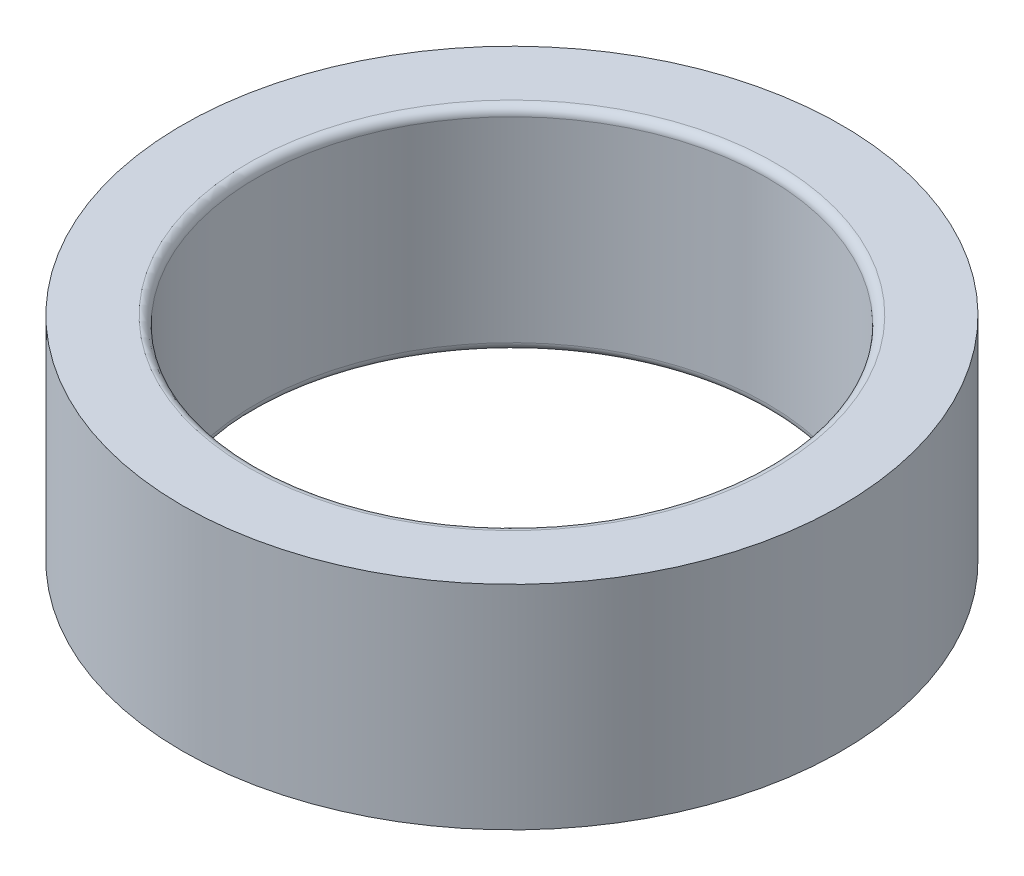
ISO-10303-21;
HEADER;
FILE_DESCRIPTION(('STEP AP214'),'2;1');
FILE_NAME('part.step','',(''),(''),'','','');
FILE_SCHEMA(('AUTOMOTIVE_DESIGN { 1 0 10303 214 1 1 1 1 }'));
ENDSEC;
DATA;
#1=APPLICATION_CONTEXT('core data for automotive mechanical design processes');
#2=APPLICATION_PROTOCOL_DEFINITION('international standard','automotive_design',2000,#1);
#3=PRODUCT_CONTEXT('',#1,'mechanical');
#4=PRODUCT('Part','Part','',(#3));
#5=PRODUCT_RELATED_PRODUCT_CATEGORY('part','',(#4));
#6=PRODUCT_DEFINITION_FORMATION('','',#4);
#7=PRODUCT_DEFINITION_CONTEXT('part definition',#1,'design');
#8=PRODUCT_DEFINITION('design','',#6,#7);
#9=PRODUCT_DEFINITION_SHAPE('','',#8);
#10=(LENGTH_UNIT() NAMED_UNIT(*) SI_UNIT(.MILLI.,.METRE.));
#11=(NAMED_UNIT(*) PLANE_ANGLE_UNIT() SI_UNIT($,.RADIAN.));
#12=(NAMED_UNIT(*) SI_UNIT($,.STERADIAN.) SOLID_ANGLE_UNIT());
#13=UNCERTAINTY_MEASURE_WITH_UNIT(LENGTH_MEASURE(1.E-05),#10,'distance_accuracy_value','');
#14=(GEOMETRIC_REPRESENTATION_CONTEXT(3) GLOBAL_UNCERTAINTY_ASSIGNED_CONTEXT((#13)) GLOBAL_UNIT_ASSIGNED_CONTEXT((#10,
#11,#12)) REPRESENTATION_CONTEXT('',''));
#15=CARTESIAN_POINT('',(0.,0.,0.));
#16=DIRECTION('',(0.,0.,1.));
#17=DIRECTION('',(1.,0.,0.));
#18=AXIS2_PLACEMENT_3D('',#15,#16,#17);
#19=CARTESIAN_POINT('',(0.,5.,0.));
#20=DIRECTION('',(0.,1.,0.));
#21=DIRECTION('',(0.,0.,1.));
#22=AXIS2_PLACEMENT_3D('',#19,#20,#21);
#23=PLANE('',#22);
#24=CARTESIAN_POINT('',(0.,5.,0.));
#25=DIRECTION('',(0.,1.,0.));
#26=DIRECTION('',(0.,0.,1.));
#27=AXIS2_PLACEMENT_3D('',#24,#25,#26);
#28=CIRCLE('',#27,6.2);
#29=CARTESIAN_POINT('',(0.,5.,6.2));
#30=VERTEX_POINT('',#29);
#31=EDGE_CURVE('E10',#30,#30,#28,.F.);
#32=ORIENTED_EDGE('',*,*,#31,.T.);
#33=EDGE_LOOP('',(#32));
#34=FACE_BOUND('',#33,.T.);
#35=CARTESIAN_POINT('',(0.,5.,0.));
#36=DIRECTION('',(0.,1.,0.));
#37=DIRECTION('',(0.,0.,1.));
#38=AXIS2_PLACEMENT_3D('',#35,#36,#37);
#39=CIRCLE('',#38,7.75);
#40=CARTESIAN_POINT('',(0.,5.,7.75));
#41=VERTEX_POINT('',#40);
#42=EDGE_CURVE('E65',#41,#41,#39,.T.);
#43=ORIENTED_EDGE('',*,*,#42,.T.);
#44=EDGE_LOOP('',(#43));
#45=FACE_BOUND('',#44,.T.);
#46=ADVANCED_FACE('F41',(#34,#45),#23,.T.);
#47=CARTESIAN_POINT('',(0.,0.,0.));
#48=DIRECTION('',(0.,1.,0.));
#49=DIRECTION('',(0.,0.,1.));
#50=AXIS2_PLACEMENT_3D('',#47,#48,#49);
#51=PLANE('',#50);
#52=CARTESIAN_POINT('',(0.,0.,0.));
#53=DIRECTION('',(0.,1.,0.));
#54=DIRECTION('',(0.,0.,1.));
#55=AXIS2_PLACEMENT_3D('',#52,#53,#54);
#56=CIRCLE('',#55,6.2);
#57=CARTESIAN_POINT('',(0.,0.,6.2));
#58=VERTEX_POINT('',#57);
#59=EDGE_CURVE('E59',#58,#58,#56,.T.);
#60=ORIENTED_EDGE('',*,*,#59,.T.);
#61=EDGE_LOOP('',(#60));
#62=FACE_BOUND('',#61,.T.);
#63=CARTESIAN_POINT('',(0.,0.,0.));
#64=DIRECTION('',(0.,1.,0.));
#65=DIRECTION('',(0.,0.,1.));
#66=AXIS2_PLACEMENT_3D('',#63,#64,#65);
#67=CIRCLE('',#66,7.75);
#68=CARTESIAN_POINT('',(0.,0.,7.75));
#69=VERTEX_POINT('',#68);
#70=EDGE_CURVE('E66',#69,#69,#67,.T.);
#71=ORIENTED_EDGE('',*,*,#70,.F.);
#72=EDGE_LOOP('',(#71));
#73=FACE_BOUND('',#72,.T.);
#74=ADVANCED_FACE('F79',(#62,#73),#51,.F.);
#75=CARTESIAN_POINT('',(0.,5.,0.));
#76=DIRECTION('',(0.,-1.,0.));
#77=DIRECTION('',(0.,0.,-1.));
#78=AXIS2_PLACEMENT_3D('',#75,#76,#77);
#79=CYLINDRICAL_SURFACE('',#78,7.75);
#80=ORIENTED_EDGE('',*,*,#42,.F.);
#81=EDGE_LOOP('',(#80));
#82=FACE_BOUND('',#81,.T.);
#83=ORIENTED_EDGE('',*,*,#70,.T.);
#84=EDGE_LOOP('',(#83));
#85=FACE_BOUND('',#84,.T.);
#86=ADVANCED_FACE('F75',(#82,#85),#79,.T.);
#87=CARTESIAN_POINT('',(0.,5.,0.));
#88=DIRECTION('',(0.,-1.,0.));
#89=DIRECTION('',(0.,0.,-1.));
#90=AXIS2_PLACEMENT_3D('',#87,#88,#89);
#91=CYLINDRICAL_SURFACE('',#90,6.);
#92=CARTESIAN_POINT('',(0.,0.2,0.));
#93=DIRECTION('',(0.,1.,0.));
#94=DIRECTION('',(0.,0.,1.));
#95=AXIS2_PLACEMENT_3D('',#92,#93,#94);
#96=CIRCLE('',#95,6.);
#97=CARTESIAN_POINT('',(0.,0.2,6.));
#98=VERTEX_POINT('',#97);
#99=EDGE_CURVE('E49',#98,#98,#96,.F.);
#100=ORIENTED_EDGE('',*,*,#99,.T.);
#101=EDGE_LOOP('',(#100));
#102=FACE_BOUND('',#101,.T.);
#103=CARTESIAN_POINT('',(0.,4.8,0.));
#104=DIRECTION('',(0.,1.,0.));
#105=DIRECTION('',(0.,0.,1.));
#106=AXIS2_PLACEMENT_3D('',#103,#104,#105);
#107=CIRCLE('',#106,6.);
#108=CARTESIAN_POINT('',(0.,4.8,6.));
#109=VERTEX_POINT('',#108);
#110=EDGE_CURVE('E54',#109,#109,#107,.T.);
#111=ORIENTED_EDGE('',*,*,#110,.T.);
#112=EDGE_LOOP('',(#111));
#113=FACE_BOUND('',#112,.T.);
#114=ADVANCED_FACE('F78',(#102,#113),#91,.F.);
#115=CARTESIAN_POINT('',(0.,0.2,0.));
#116=DIRECTION('',(0.,1.,0.));
#117=DIRECTION('',(0.,0.,1.));
#118=AXIS2_PLACEMENT_3D('',#115,#116,#117);
#119=TOROIDAL_SURFACE('',#118,6.2,0.2);
#120=ORIENTED_EDGE('',*,*,#99,.F.);
#121=EDGE_LOOP('',(#120));
#122=FACE_BOUND('',#121,.T.);
#123=ORIENTED_EDGE('',*,*,#59,.F.);
#124=EDGE_LOOP('',(#123));
#125=FACE_BOUND('',#124,.T.);
#126=ADVANCED_FACE('F91',(#122,#125),#119,.T.);
#127=CARTESIAN_POINT('',(0.,4.8,0.));
#128=DIRECTION('',(0.,1.,0.));
#129=DIRECTION('',(0.,0.,1.));
#130=AXIS2_PLACEMENT_3D('',#127,#128,#129);
#131=TOROIDAL_SURFACE('',#130,6.2,0.2);
#132=ORIENTED_EDGE('',*,*,#31,.F.);
#133=EDGE_LOOP('',(#132));
#134=FACE_BOUND('',#133,.T.);
#135=ORIENTED_EDGE('',*,*,#110,.F.);
#136=EDGE_LOOP('',(#135));
#137=FACE_BOUND('',#136,.T.);
#138=ADVANCED_FACE('F43',(#134,#137),#131,.T.);
#139=CLOSED_SHELL('',(#46,#74,#86,#114,#126,#138));
#140=MANIFOLD_SOLID_BREP('B2',#139);
#141=ADVANCED_BREP_SHAPE_REPRESENTATION('',(#18,#140),#14);
#142=SHAPE_DEFINITION_REPRESENTATION(#9,#141);
ENDSEC;
END-ISO-10303-21;
